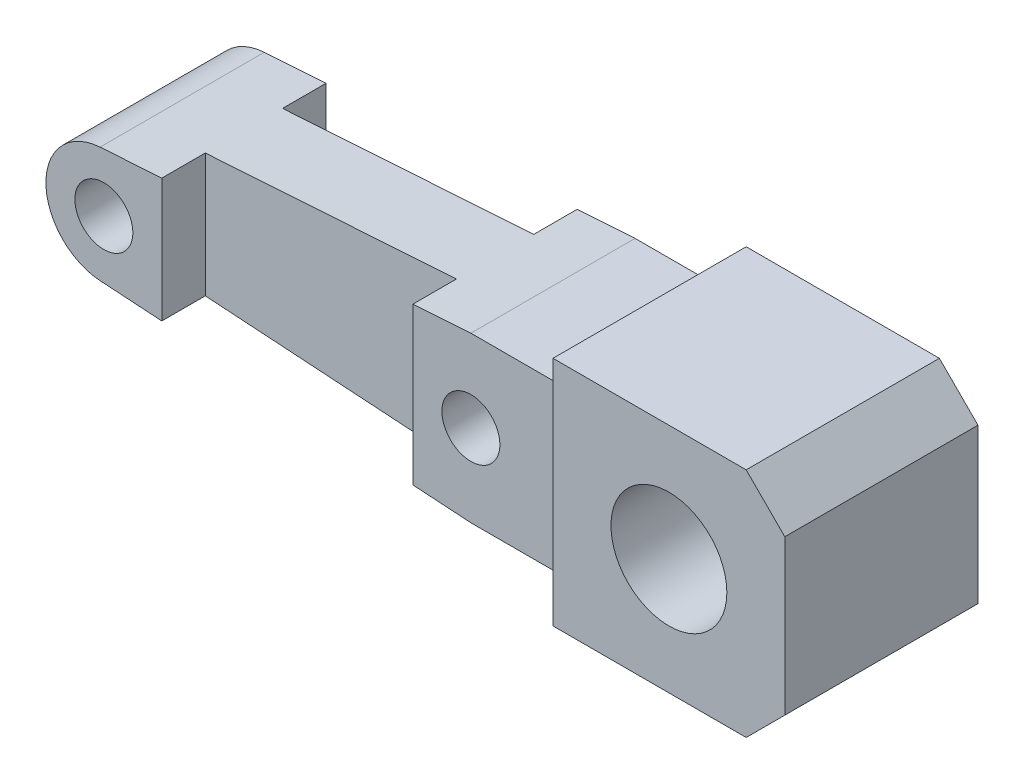
ISO-10303-21;
HEADER;
FILE_DESCRIPTION(('STEP AP214'),'2;1');
FILE_NAME('part.step','',(''),(''),'','','');
FILE_SCHEMA(('AUTOMOTIVE_DESIGN { 1 0 10303 214 1 1 1 1 }'));
ENDSEC;
DATA;
#1=APPLICATION_CONTEXT('core data for automotive mechanical design processes');
#2=APPLICATION_PROTOCOL_DEFINITION('international standard','automotive_design',2000,#1);
#3=PRODUCT_CONTEXT('',#1,'mechanical');
#4=PRODUCT('Part','Part','',(#3));
#5=PRODUCT_RELATED_PRODUCT_CATEGORY('part','',(#4));
#6=PRODUCT_DEFINITION_FORMATION('','',#4);
#7=PRODUCT_DEFINITION_CONTEXT('part definition',#1,'design');
#8=PRODUCT_DEFINITION('design','',#6,#7);
#9=PRODUCT_DEFINITION_SHAPE('','',#8);
#10=(LENGTH_UNIT() NAMED_UNIT(*) SI_UNIT(.MILLI.,.METRE.));
#11=(NAMED_UNIT(*) PLANE_ANGLE_UNIT() SI_UNIT($,.RADIAN.));
#12=(NAMED_UNIT(*) SI_UNIT($,.STERADIAN.) SOLID_ANGLE_UNIT());
#13=UNCERTAINTY_MEASURE_WITH_UNIT(LENGTH_MEASURE(1.E-05),#10,'distance_accuracy_value','');
#14=(GEOMETRIC_REPRESENTATION_CONTEXT(3) GLOBAL_UNCERTAINTY_ASSIGNED_CONTEXT((#13)) GLOBAL_UNIT_ASSIGNED_CONTEXT((#10,
#11,#12)) REPRESENTATION_CONTEXT('',''));
#15=CARTESIAN_POINT('',(0.,0.,0.));
#16=DIRECTION('',(0.,0.,1.));
#17=DIRECTION('',(1.,0.,0.));
#18=AXIS2_PLACEMENT_3D('',#15,#16,#17);
#19=CARTESIAN_POINT('',(-0.647809855023762,-9.8975356751646,20.));
#20=DIRECTION('',(-0.0653118854111001,-0.997864899484919,0.));
#21=DIRECTION('',(0.997864899484919,-0.0653118854111001,0.));
#22=AXIS2_PLACEMENT_3D('',#19,#20,#21);
#23=PLANE('',#22);
#24=DIRECTION('',(-0.997864899484919,0.0653118854111001,0.));
#25=VECTOR('',#24,1.);
#26=CARTESIAN_POINT('',(-0.647809855023762,-9.8975356751646,1.5));
#27=LINE('',#26,#25);
#28=CARTESIAN_POINT('',(-54.,-6.40554780087564,1.5));
#29=VERTEX_POINT('',#28);
#30=CARTESIAN_POINT('',(-60.3918713124666,-5.98718939690953,1.5));
#31=VERTEX_POINT('',#30);
#32=EDGE_CURVE('E48',#29,#31,#27,.T.);
#33=ORIENTED_EDGE('',*,*,#32,.F.);
#34=DIRECTION('',(0.,0.,1.));
#35=VECTOR('',#34,1.);
#36=CARTESIAN_POINT('',(-54.,-6.40554780087564,20.));
#37=LINE('',#36,#35);
#38=CARTESIAN_POINT('',(-54.,-6.40554780087564,6.));
#39=VERTEX_POINT('',#38);
#40=EDGE_CURVE('E356',#29,#39,#37,.T.);
#41=ORIENTED_EDGE('',*,*,#40,.T.);
#42=DIRECTION('',(-0.997864899484919,0.0653118854111001,0.));
#43=VECTOR('',#42,1.);
#44=CARTESIAN_POINT('',(-0.647809855023762,-9.8975356751646,6.));
#45=LINE('',#44,#43);
#46=CARTESIAN_POINT('',(-28.,-8.10729021266419,6.));
#47=VERTEX_POINT('',#46);
#48=EDGE_CURVE('E353',#47,#39,#45,.T.);
#49=ORIENTED_EDGE('',*,*,#48,.F.);
#50=DIRECTION('',(0.,0.,-1.));
#51=VECTOR('',#50,1.);
#52=CARTESIAN_POINT('',(-28.,-8.10729021266419,6.));
#53=LINE('',#52,#51);
#54=CARTESIAN_POINT('',(-28.,-8.10729021266419,1.5));
#55=VERTEX_POINT('',#54);
#56=EDGE_CURVE('E337',#47,#55,#53,.T.);
#57=ORIENTED_EDGE('',*,*,#56,.T.);
#58=DIRECTION('',(-0.997864899484919,0.0653118854111001,0.));
#59=VECTOR('',#58,1.);
#60=CARTESIAN_POINT('',(-0.647809855023762,-9.8975356751646,1.5));
#61=LINE('',#60,#59);
#62=CARTESIAN_POINT('',(-22.,-8.50000000000001,1.5));
#63=VERTEX_POINT('',#62);
#64=EDGE_CURVE('E377',#63,#55,#61,.T.);
#65=ORIENTED_EDGE('',*,*,#64,.F.);
#66=DIRECTION('',(0.,0.,-1.));
#67=VECTOR('',#66,1.);
#68=CARTESIAN_POINT('',(-22.,-8.50000000000001,20.));
#69=LINE('',#68,#67);
#70=CARTESIAN_POINT('',(-22.,-8.50000000000001,18.5));
#71=VERTEX_POINT('',#70);
#72=EDGE_CURVE('E174',#71,#63,#69,.T.);
#73=ORIENTED_EDGE('',*,*,#72,.F.);
#74=DIRECTION('',(0.997864899484919,-0.0653118854111001,0.));
#75=VECTOR('',#74,1.);
#76=CARTESIAN_POINT('',(-0.647809855023762,-9.8975356751646,18.5));
#77=LINE('',#76,#75);
#78=CARTESIAN_POINT('',(-28.,-8.10729021266419,18.5));
#79=VERTEX_POINT('',#78);
#80=EDGE_CURVE('E142',#79,#71,#77,.T.);
#81=ORIENTED_EDGE('',*,*,#80,.F.);
#82=DIRECTION('',(0.,0.,1.));
#83=VECTOR('',#82,1.);
#84=CARTESIAN_POINT('',(-28.,-8.10729021266419,14.));
#85=LINE('',#84,#83);
#86=CARTESIAN_POINT('',(-28.,-8.10729021266419,14.));
#87=VERTEX_POINT('',#86);
#88=EDGE_CURVE('E386',#87,#79,#85,.T.);
#89=ORIENTED_EDGE('',*,*,#88,.F.);
#90=DIRECTION('',(0.997864899484919,-0.0653118854111001,0.));
#91=VECTOR('',#90,1.);
#92=CARTESIAN_POINT('',(-0.647809855023762,-9.8975356751646,14.));
#93=LINE('',#92,#91);
#94=CARTESIAN_POINT('',(-54.,-6.40554780087564,14.));
#95=VERTEX_POINT('',#94);
#96=EDGE_CURVE('E394',#95,#87,#93,.T.);
#97=ORIENTED_EDGE('',*,*,#96,.F.);
#98=DIRECTION('',(0.,0.,-1.));
#99=VECTOR('',#98,1.);
#100=CARTESIAN_POINT('',(-54.,-6.40554780087564,20.));
#101=LINE('',#100,#99);
#102=CARTESIAN_POINT('',(-54.,-6.40554780087564,18.5));
#103=VERTEX_POINT('',#102);
#104=EDGE_CURVE('E210',#103,#95,#101,.T.);
#105=ORIENTED_EDGE('',*,*,#104,.F.);
#106=DIRECTION('',(0.997864899484919,-0.0653118854111001,0.));
#107=VECTOR('',#106,1.);
#108=CARTESIAN_POINT('',(-0.647809855023762,-9.8975356751646,18.5));
#109=LINE('',#108,#107);
#110=CARTESIAN_POINT('',(-60.3918713124666,-5.98718939690953,18.5));
#111=VERTEX_POINT('',#110);
#112=EDGE_CURVE('E206',#111,#103,#109,.T.);
#113=ORIENTED_EDGE('',*,*,#112,.F.);
#114=DIRECTION('',(0.,0.,-1.));
#115=VECTOR('',#114,1.);
#116=CARTESIAN_POINT('',(-60.3918713124666,-5.98718939690953,20.));
#117=LINE('',#116,#115);
#118=EDGE_CURVE('E134',#111,#31,#117,.T.);
#119=ORIENTED_EDGE('',*,*,#118,.T.);
#120=EDGE_LOOP('',(#33,#41,#49,#57,#65,#73,#81,#89,#97,#105,#113,#119));
#121=FACE_BOUND('',#120,.T.);
#122=ADVANCED_FACE('F34',(#121),#23,.T.);
#123=CARTESIAN_POINT('',(-0.647809855023766,9.8975356751646,20.));
#124=DIRECTION('',(0.0653118854111005,-0.997864899484919,0.));
#125=DIRECTION('',(0.997864899484919,0.0653118854111005,0.));
#126=AXIS2_PLACEMENT_3D('',#123,#124,#125);
#127=PLANE('',#126);
#128=DIRECTION('',(0.,0.,-1.));
#129=VECTOR('',#128,1.);
#130=CARTESIAN_POINT('',(-28.,8.10729021266418,6.));
#131=LINE('',#130,#129);
#132=CARTESIAN_POINT('',(-28.,8.10729021266418,6.));
#133=VERTEX_POINT('',#132);
#134=CARTESIAN_POINT('',(-28.,8.10729021266418,1.5));
#135=VERTEX_POINT('',#134);
#136=EDGE_CURVE('E347',#133,#135,#131,.T.);
#137=ORIENTED_EDGE('',*,*,#136,.F.);
#138=DIRECTION('',(-0.997864899484919,-0.0653118854111005,0.));
#139=VECTOR('',#138,1.);
#140=CARTESIAN_POINT('',(-0.647809855023766,9.8975356751646,6.));
#141=LINE('',#140,#139);
#142=CARTESIAN_POINT('',(-54.,6.40554780087562,6.));
#143=VERTEX_POINT('',#142);
#144=EDGE_CURVE('E11',#133,#143,#141,.T.);
#145=ORIENTED_EDGE('',*,*,#144,.T.);
#146=DIRECTION('',(0.,0.,1.));
#147=VECTOR('',#146,1.);
#148=CARTESIAN_POINT('',(-54.,6.40554780087562,20.));
#149=LINE('',#148,#147);
#150=CARTESIAN_POINT('',(-54.,6.40554780087562,1.5));
#151=VERTEX_POINT('',#150);
#152=EDGE_CURVE('E361',#151,#143,#149,.T.);
#153=ORIENTED_EDGE('',*,*,#152,.F.);
#154=DIRECTION('',(-0.997864899484919,-0.0653118854111005,0.));
#155=VECTOR('',#154,1.);
#156=CARTESIAN_POINT('',(-0.647809855023766,9.8975356751646,1.5));
#157=LINE('',#156,#155);
#158=CARTESIAN_POINT('',(-60.3918713124666,5.9871893969095,1.5));
#159=VERTEX_POINT('',#158);
#160=EDGE_CURVE('E359',#151,#159,#157,.T.);
#161=ORIENTED_EDGE('',*,*,#160,.T.);
#162=DIRECTION('',(0.,0.,-1.));
#163=VECTOR('',#162,1.);
#164=CARTESIAN_POINT('',(-60.3918713124666,5.9871893969095,20.));
#165=LINE('',#164,#163);
#166=CARTESIAN_POINT('',(-60.3918713124666,5.9871893969095,18.5));
#167=VERTEX_POINT('',#166);
#168=EDGE_CURVE('E153',#167,#159,#165,.T.);
#169=ORIENTED_EDGE('',*,*,#168,.F.);
#170=DIRECTION('',(0.997864899484919,0.0653118854111005,0.));
#171=VECTOR('',#170,1.);
#172=CARTESIAN_POINT('',(-0.647809855023766,9.8975356751646,18.5));
#173=LINE('',#172,#171);
#174=CARTESIAN_POINT('',(-54.,6.40554780087562,18.5));
#175=VERTEX_POINT('',#174);
#176=EDGE_CURVE('E218',#167,#175,#173,.T.);
#177=ORIENTED_EDGE('',*,*,#176,.T.);
#178=DIRECTION('',(0.,0.,-1.));
#179=VECTOR('',#178,1.);
#180=CARTESIAN_POINT('',(-54.,6.40554780087562,20.));
#181=LINE('',#180,#179);
#182=CARTESIAN_POINT('',(-54.,6.40554780087562,14.));
#183=VERTEX_POINT('',#182);
#184=EDGE_CURVE('E388',#175,#183,#181,.T.);
#185=ORIENTED_EDGE('',*,*,#184,.T.);
#186=DIRECTION('',(0.997864899484919,0.0653118854111005,0.));
#187=VECTOR('',#186,1.);
#188=CARTESIAN_POINT('',(-0.647809855023766,9.8975356751646,14.));
#189=LINE('',#188,#187);
#190=CARTESIAN_POINT('',(-28.,8.10729021266418,14.));
#191=VERTEX_POINT('',#190);
#192=EDGE_CURVE('E185',#183,#191,#189,.T.);
#193=ORIENTED_EDGE('',*,*,#192,.T.);
#194=DIRECTION('',(0.,0.,1.));
#195=VECTOR('',#194,1.);
#196=CARTESIAN_POINT('',(-28.,8.10729021266418,14.));
#197=LINE('',#196,#195);
#198=CARTESIAN_POINT('',(-28.,8.10729021266418,18.5));
#199=VERTEX_POINT('',#198);
#200=EDGE_CURVE('E385',#191,#199,#197,.T.);
#201=ORIENTED_EDGE('',*,*,#200,.T.);
#202=DIRECTION('',(0.997864899484919,0.0653118854111005,0.));
#203=VECTOR('',#202,1.);
#204=CARTESIAN_POINT('',(-0.647809855023766,9.8975356751646,18.5));
#205=LINE('',#204,#203);
#206=CARTESIAN_POINT('',(-22.0000000000002,8.49999999999999,18.5));
#207=VERTEX_POINT('',#206);
#208=EDGE_CURVE('E181',#199,#207,#205,.T.);
#209=ORIENTED_EDGE('',*,*,#208,.T.);
#210=DIRECTION('',(0.,0.,-1.));
#211=VECTOR('',#210,1.);
#212=CARTESIAN_POINT('',(-22.,8.49999999999999,20.));
#213=LINE('',#212,#211);
#214=CARTESIAN_POINT('',(-22.0000000000002,8.49999999999999,1.5));
#215=VERTEX_POINT('',#214);
#216=EDGE_CURVE('E156',#207,#215,#213,.T.);
#217=ORIENTED_EDGE('',*,*,#216,.T.);
#218=DIRECTION('',(-0.997864899484919,-0.0653118854111005,0.));
#219=VECTOR('',#218,1.);
#220=CARTESIAN_POINT('',(-0.647809855023766,9.8975356751646,1.5));
#221=LINE('',#220,#219);
#222=EDGE_CURVE('E190',#215,#135,#221,.T.);
#223=ORIENTED_EDGE('',*,*,#222,.T.);
#224=EDGE_LOOP('',(#137,#145,#153,#161,#169,#177,#185,#193,#201,#209,#217,#223));
#225=FACE_BOUND('',#224,.T.);
#226=ADVANCED_FACE('F398',(#225),#127,.F.);
#227=CARTESIAN_POINT('',(0.,0.,0.));
#228=DIRECTION('',(0.,0.,1.));
#229=DIRECTION('',(1.,0.,0.));
#230=AXIS2_PLACEMENT_3D('',#227,#228,#229);
#231=PLANE('',#230);
#232=CARTESIAN_POINT('',(0.,0.,0.));
#233=DIRECTION('',(0.,0.,1.));
#234=DIRECTION('',(1.,0.,0.));
#235=AXIS2_PLACEMENT_3D('',#232,#233,#234);
#236=CIRCLE('',#235,6.);
#237=CARTESIAN_POINT('',(6.,0.,0.));
#238=VERTEX_POINT('',#237);
#239=EDGE_CURVE('E137',#238,#238,#236,.T.);
#240=ORIENTED_EDGE('',*,*,#239,.T.);
#241=EDGE_LOOP('',(#240));
#242=FACE_BOUND('',#241,.T.);
#243=DIRECTION('',(-1.,0.,0.));
#244=VECTOR('',#243,1.);
#245=CARTESIAN_POINT('',(0.,-12.,0.));
#246=LINE('',#245,#244);
#247=CARTESIAN_POINT('',(8.,-12.,0.));
#248=VERTEX_POINT('',#247);
#249=CARTESIAN_POINT('',(-12.,-12.,0.));
#250=VERTEX_POINT('',#249);
#251=EDGE_CURVE('E138',#248,#250,#246,.T.);
#252=ORIENTED_EDGE('',*,*,#251,.T.);
#253=DIRECTION('',(0.,-1.,0.));
#254=VECTOR('',#253,1.);
#255=CARTESIAN_POINT('',(-12.,0.,0.));
#256=LINE('',#255,#254);
#257=CARTESIAN_POINT('',(-12.,12.,0.));
#258=VERTEX_POINT('',#257);
#259=EDGE_CURVE('E135',#258,#250,#256,.T.);
#260=ORIENTED_EDGE('',*,*,#259,.F.);
#261=DIRECTION('',(-1.,0.,0.));
#262=VECTOR('',#261,1.);
#263=CARTESIAN_POINT('',(0.,12.,0.));
#264=LINE('',#263,#262);
#265=CARTESIAN_POINT('',(8.,12.,0.));
#266=VERTEX_POINT('',#265);
#267=EDGE_CURVE('E86',#266,#258,#264,.T.);
#268=ORIENTED_EDGE('',*,*,#267,.F.);
#269=DIRECTION('',(-0.707106781186548,0.707106781186547,0.));
#270=VECTOR('',#269,1.);
#271=CARTESIAN_POINT('',(10.,10.,0.));
#272=LINE('',#271,#270);
#273=CARTESIAN_POINT('',(12.,8.,0.));
#274=VERTEX_POINT('',#273);
#275=EDGE_CURVE('E146',#274,#266,#272,.T.);
#276=ORIENTED_EDGE('',*,*,#275,.F.);
#277=DIRECTION('',(0.,-1.,0.));
#278=VECTOR('',#277,1.);
#279=CARTESIAN_POINT('',(12.,0.,0.));
#280=LINE('',#279,#278);
#281=CARTESIAN_POINT('',(12.,-8.,0.));
#282=VERTEX_POINT('',#281);
#283=EDGE_CURVE('E108',#274,#282,#280,.T.);
#284=ORIENTED_EDGE('',*,*,#283,.T.);
#285=DIRECTION('',(-0.707106781186548,-0.707106781186548,0.));
#286=VECTOR('',#285,1.);
#287=CARTESIAN_POINT('',(10.,-10.,0.));
#288=LINE('',#287,#286);
#289=EDGE_CURVE('E141',#282,#248,#288,.T.);
#290=ORIENTED_EDGE('',*,*,#289,.T.);
#291=EDGE_LOOP('',(#252,#260,#268,#276,#284,#290));
#292=FACE_BOUND('',#291,.T.);
#293=ADVANCED_FACE('F250',(#242,#292),#231,.F.);
#294=CARTESIAN_POINT('',(0.,0.,20.));
#295=DIRECTION('',(0.,0.,1.));
#296=DIRECTION('',(1.,0.,0.));
#297=AXIS2_PLACEMENT_3D('',#294,#295,#296);
#298=PLANE('',#297);
#299=DIRECTION('',(-1.,0.,0.));
#300=VECTOR('',#299,1.);
#301=CARTESIAN_POINT('',(0.,12.,20.));
#302=LINE('',#301,#300);
#303=CARTESIAN_POINT('',(8.,12.,20.));
#304=VERTEX_POINT('',#303);
#305=CARTESIAN_POINT('',(-12.,12.,20.));
#306=VERTEX_POINT('',#305);
#307=EDGE_CURVE('E118',#304,#306,#302,.T.);
#308=ORIENTED_EDGE('',*,*,#307,.T.);
#309=DIRECTION('',(0.,-1.,0.));
#310=VECTOR('',#309,1.);
#311=CARTESIAN_POINT('',(-12.,0.,20.));
#312=LINE('',#311,#310);
#313=CARTESIAN_POINT('',(-12.,-12.,20.));
#314=VERTEX_POINT('',#313);
#315=EDGE_CURVE('E57',#306,#314,#312,.T.);
#316=ORIENTED_EDGE('',*,*,#315,.T.);
#317=DIRECTION('',(-1.,0.,0.));
#318=VECTOR('',#317,1.);
#319=CARTESIAN_POINT('',(0.,-12.,20.));
#320=LINE('',#319,#318);
#321=CARTESIAN_POINT('',(8.,-12.,20.));
#322=VERTEX_POINT('',#321);
#323=EDGE_CURVE('E126',#322,#314,#320,.T.);
#324=ORIENTED_EDGE('',*,*,#323,.F.);
#325=DIRECTION('',(-0.707106781186548,-0.707106781186548,0.));
#326=VECTOR('',#325,1.);
#327=CARTESIAN_POINT('',(10.,-10.,20.));
#328=LINE('',#327,#326);
#329=CARTESIAN_POINT('',(12.,-8.,20.));
#330=VERTEX_POINT('',#329);
#331=EDGE_CURVE('E124',#330,#322,#328,.T.);
#332=ORIENTED_EDGE('',*,*,#331,.F.);
#333=DIRECTION('',(0.,-1.,0.));
#334=VECTOR('',#333,1.);
#335=CARTESIAN_POINT('',(12.,0.,20.));
#336=LINE('',#335,#334);
#337=CARTESIAN_POINT('',(12.,8.,20.));
#338=VERTEX_POINT('',#337);
#339=EDGE_CURVE('E106',#338,#330,#336,.T.);
#340=ORIENTED_EDGE('',*,*,#339,.F.);
#341=DIRECTION('',(-0.707106781186548,0.707106781186547,0.));
#342=VECTOR('',#341,1.);
#343=CARTESIAN_POINT('',(10.,10.,20.));
#344=LINE('',#343,#342);
#345=EDGE_CURVE('E115',#338,#304,#344,.T.);
#346=ORIENTED_EDGE('',*,*,#345,.T.);
#347=EDGE_LOOP('',(#308,#316,#324,#332,#340,#346));
#348=FACE_BOUND('',#347,.T.);
#349=CARTESIAN_POINT('',(0.,0.,20.));
#350=DIRECTION('',(0.,0.,1.));
#351=DIRECTION('',(1.,0.,0.));
#352=AXIS2_PLACEMENT_3D('',#349,#350,#351);
#353=CIRCLE('',#352,6.);
#354=CARTESIAN_POINT('',(6.,0.,20.));
#355=VERTEX_POINT('',#354);
#356=EDGE_CURVE('E131',#355,#355,#353,.T.);
#357=ORIENTED_EDGE('',*,*,#356,.F.);
#358=EDGE_LOOP('',(#357));
#359=FACE_BOUND('',#358,.T.);
#360=ADVANCED_FACE('F121',(#348,#359),#298,.T.);
#361=CARTESIAN_POINT('',(0.,-8.5,20.));
#362=DIRECTION('',(0.,-1.,0.));
#363=DIRECTION('',(1.,0.,0.));
#364=AXIS2_PLACEMENT_3D('',#361,#362,#363);
#365=PLANE('',#364);
#366=DIRECTION('',(1.,0.,0.));
#367=VECTOR('',#366,1.);
#368=CARTESIAN_POINT('',(-12.,-8.50000000000001,1.5));
#369=LINE('',#368,#367);
#370=CARTESIAN_POINT('',(-12.,-8.50000000000001,1.5));
#371=VERTEX_POINT('',#370);
#372=EDGE_CURVE('E274',#63,#371,#369,.T.);
#373=ORIENTED_EDGE('',*,*,#372,.T.);
#374=DIRECTION('',(0.,0.,-1.));
#375=VECTOR('',#374,1.);
#376=CARTESIAN_POINT('',(-12.,-8.5,20.));
#377=LINE('',#376,#375);
#378=CARTESIAN_POINT('',(-12.,-8.50000000000001,18.5));
#379=VERTEX_POINT('',#378);
#380=EDGE_CURVE('E171',#379,#371,#377,.T.);
#381=ORIENTED_EDGE('',*,*,#380,.F.);
#382=DIRECTION('',(1.,0.,0.));
#383=VECTOR('',#382,1.);
#384=CARTESIAN_POINT('',(-12.,-8.50000000000001,18.5));
#385=LINE('',#384,#383);
#386=EDGE_CURVE('E182',#71,#379,#385,.T.);
#387=ORIENTED_EDGE('',*,*,#386,.F.);
#388=ORIENTED_EDGE('',*,*,#72,.T.);
#389=EDGE_LOOP('',(#373,#381,#387,#388));
#390=FACE_BOUND('',#389,.T.);
#391=ADVANCED_FACE('F271',(#390),#365,.T.);
#392=CARTESIAN_POINT('',(0.,-12.,20.));
#393=DIRECTION('',(0.,-1.,0.));
#394=DIRECTION('',(1.,0.,0.));
#395=AXIS2_PLACEMENT_3D('',#392,#393,#394);
#396=PLANE('',#395);
#397=ORIENTED_EDGE('',*,*,#251,.F.);
#398=DIRECTION('',(0.,0.,-1.));
#399=VECTOR('',#398,1.);
#400=CARTESIAN_POINT('',(8.,-12.,20.));
#401=LINE('',#400,#399);
#402=EDGE_CURVE('E166',#322,#248,#401,.T.);
#403=ORIENTED_EDGE('',*,*,#402,.F.);
#404=ORIENTED_EDGE('',*,*,#323,.T.);
#405=DIRECTION('',(0.,0.,-1.));
#406=VECTOR('',#405,1.);
#407=CARTESIAN_POINT('',(-12.,-12.,20.));
#408=LINE('',#407,#406);
#409=EDGE_CURVE('E168',#314,#250,#408,.T.);
#410=ORIENTED_EDGE('',*,*,#409,.T.);
#411=EDGE_LOOP('',(#397,#403,#404,#410));
#412=FACE_BOUND('',#411,.T.);
#413=ADVANCED_FACE('F245',(#412),#396,.T.);
#414=CARTESIAN_POINT('',(10.,-10.,20.));
#415=DIRECTION('',(0.707106781186548,-0.707106781186548,0.));
#416=DIRECTION('',(0.707106781186548,0.707106781186548,0.));
#417=AXIS2_PLACEMENT_3D('',#414,#415,#416);
#418=PLANE('',#417);
#419=ORIENTED_EDGE('',*,*,#289,.F.);
#420=DIRECTION('',(0.,0.,-1.));
#421=VECTOR('',#420,1.);
#422=CARTESIAN_POINT('',(12.,-8.,20.));
#423=LINE('',#422,#421);
#424=EDGE_CURVE('E111',#330,#282,#423,.T.);
#425=ORIENTED_EDGE('',*,*,#424,.F.);
#426=ORIENTED_EDGE('',*,*,#331,.T.);
#427=ORIENTED_EDGE('',*,*,#402,.T.);
#428=EDGE_LOOP('',(#419,#425,#426,#427));
#429=FACE_BOUND('',#428,.T.);
#430=ADVANCED_FACE('F248',(#429),#418,.T.);
#431=CARTESIAN_POINT('',(12.,0.,20.));
#432=DIRECTION('',(1.,0.,0.));
#433=DIRECTION('',(0.,1.,0.));
#434=AXIS2_PLACEMENT_3D('',#431,#432,#433);
#435=PLANE('',#434);
#436=ORIENTED_EDGE('',*,*,#283,.F.);
#437=DIRECTION('',(0.,0.,-1.));
#438=VECTOR('',#437,1.);
#439=CARTESIAN_POINT('',(12.,8.,20.));
#440=LINE('',#439,#438);
#441=EDGE_CURVE('E102',#338,#274,#440,.T.);
#442=ORIENTED_EDGE('',*,*,#441,.F.);
#443=ORIENTED_EDGE('',*,*,#339,.T.);
#444=ORIENTED_EDGE('',*,*,#424,.T.);
#445=EDGE_LOOP('',(#436,#442,#443,#444));
#446=FACE_BOUND('',#445,.T.);
#447=ADVANCED_FACE('F104',(#446),#435,.T.);
#448=CARTESIAN_POINT('',(10.,10.,20.));
#449=DIRECTION('',(-0.707106781186547,-0.707106781186548,0.));
#450=DIRECTION('',(0.707106781186548,-0.707106781186547,0.));
#451=AXIS2_PLACEMENT_3D('',#448,#449,#450);
#452=PLANE('',#451);
#453=ORIENTED_EDGE('',*,*,#275,.T.);
#454=DIRECTION('',(0.,0.,-1.));
#455=VECTOR('',#454,1.);
#456=CARTESIAN_POINT('',(8.,12.,20.));
#457=LINE('',#456,#455);
#458=EDGE_CURVE('E112',#304,#266,#457,.T.);
#459=ORIENTED_EDGE('',*,*,#458,.F.);
#460=ORIENTED_EDGE('',*,*,#345,.F.);
#461=ORIENTED_EDGE('',*,*,#441,.T.);
#462=EDGE_LOOP('',(#453,#459,#460,#461));
#463=FACE_BOUND('',#462,.T.);
#464=ADVANCED_FACE('F116',(#463),#452,.F.);
#465=CARTESIAN_POINT('',(0.,12.,20.));
#466=DIRECTION('',(0.,-1.,0.));
#467=DIRECTION('',(1.,0.,0.));
#468=AXIS2_PLACEMENT_3D('',#465,#466,#467);
#469=PLANE('',#468);
#470=ORIENTED_EDGE('',*,*,#267,.T.);
#471=DIRECTION('',(0.,0.,-1.));
#472=VECTOR('',#471,1.);
#473=CARTESIAN_POINT('',(-12.,12.,20.));
#474=LINE('',#473,#472);
#475=EDGE_CURVE('E162',#306,#258,#474,.T.);
#476=ORIENTED_EDGE('',*,*,#475,.F.);
#477=ORIENTED_EDGE('',*,*,#307,.F.);
#478=ORIENTED_EDGE('',*,*,#458,.T.);
#479=EDGE_LOOP('',(#470,#476,#477,#478));
#480=FACE_BOUND('',#479,.T.);
#481=ADVANCED_FACE('F252',(#480),#469,.F.);
#482=CARTESIAN_POINT('',(-12.,0.,20.));
#483=DIRECTION('',(1.,0.,0.));
#484=DIRECTION('',(0.,1.,0.));
#485=AXIS2_PLACEMENT_3D('',#482,#483,#484);
#486=PLANE('',#485);
#487=ORIENTED_EDGE('',*,*,#259,.T.);
#488=ORIENTED_EDGE('',*,*,#409,.F.);
#489=ORIENTED_EDGE('',*,*,#315,.F.);
#490=ORIENTED_EDGE('',*,*,#475,.T.);
#491=EDGE_LOOP('',(#487,#488,#489,#490));
#492=FACE_BOUND('',#491,.T.);
#493=ORIENTED_EDGE('',*,*,#380,.T.);
#494=DIRECTION('',(0.,1.,0.));
#495=VECTOR('',#494,1.);
#496=CARTESIAN_POINT('',(-12.,8.5,1.5));
#497=LINE('',#496,#495);
#498=CARTESIAN_POINT('',(-12.,8.5,1.5));
#499=VERTEX_POINT('',#498);
#500=EDGE_CURVE('E265',#371,#499,#497,.T.);
#501=ORIENTED_EDGE('',*,*,#500,.T.);
#502=DIRECTION('',(0.,0.,-1.));
#503=VECTOR('',#502,1.);
#504=CARTESIAN_POINT('',(-12.,8.5,20.));
#505=LINE('',#504,#503);
#506=CARTESIAN_POINT('',(-12.,8.5,18.5));
#507=VERTEX_POINT('',#506);
#508=EDGE_CURVE('E159',#507,#499,#505,.T.);
#509=ORIENTED_EDGE('',*,*,#508,.F.);
#510=DIRECTION('',(0.,1.,0.));
#511=VECTOR('',#510,1.);
#512=CARTESIAN_POINT('',(-12.,8.5,18.5));
#513=LINE('',#512,#511);
#514=EDGE_CURVE('E221',#379,#507,#513,.T.);
#515=ORIENTED_EDGE('',*,*,#514,.F.);
#516=EDGE_LOOP('',(#493,#501,#509,#515));
#517=FACE_BOUND('',#516,.T.);
#518=ADVANCED_FACE('F253',(#492,#517),#486,.F.);
#519=CARTESIAN_POINT('',(0.,8.5,20.));
#520=DIRECTION('',(0.,-1.,0.));
#521=DIRECTION('',(1.,0.,0.));
#522=AXIS2_PLACEMENT_3D('',#519,#520,#521);
#523=PLANE('',#522);
#524=ORIENTED_EDGE('',*,*,#508,.T.);
#525=DIRECTION('',(-1.,0.,0.));
#526=VECTOR('',#525,1.);
#527=CARTESIAN_POINT('',(-12.,8.5,1.5));
#528=LINE('',#527,#526);
#529=EDGE_CURVE('E191',#499,#215,#528,.T.);
#530=ORIENTED_EDGE('',*,*,#529,.T.);
#531=ORIENTED_EDGE('',*,*,#216,.F.);
#532=DIRECTION('',(-1.,0.,0.));
#533=VECTOR('',#532,1.);
#534=CARTESIAN_POINT('',(-12.,8.5,18.5));
#535=LINE('',#534,#533);
#536=EDGE_CURVE('E230',#507,#207,#535,.T.);
#537=ORIENTED_EDGE('',*,*,#536,.F.);
#538=EDGE_LOOP('',(#524,#530,#531,#537));
#539=FACE_BOUND('',#538,.T.);
#540=ADVANCED_FACE('F256',(#539),#523,.F.);
#541=CARTESIAN_POINT('',(-22.,0.,20.));
#542=DIRECTION('',(0.,0.,-1.));
#543=DIRECTION('',(-1.,0.,0.));
#544=AXIS2_PLACEMENT_3D('',#541,#542,#543);
#545=CYLINDRICAL_SURFACE('',#544,3.);
#546=CARTESIAN_POINT('',(-22.,0.,1.5));
#547=DIRECTION('',(0.,0.,1.));
#548=DIRECTION('',(1.,0.,0.));
#549=AXIS2_PLACEMENT_3D('',#546,#547,#548);
#550=CIRCLE('',#549,3.);
#551=CARTESIAN_POINT('',(-19.,0.,1.5));
#552=VERTEX_POINT('',#551);
#553=EDGE_CURVE('E188',#552,#552,#550,.T.);
#554=ORIENTED_EDGE('',*,*,#553,.F.);
#555=EDGE_LOOP('',(#554));
#556=FACE_BOUND('',#555,.T.);
#557=CARTESIAN_POINT('',(-22.,0.,18.5));
#558=DIRECTION('',(0.,0.,-1.));
#559=DIRECTION('',(-1.,0.,0.));
#560=AXIS2_PLACEMENT_3D('',#557,#558,#559);
#561=CIRCLE('',#560,3.);
#562=CARTESIAN_POINT('',(-25.,0.,18.5));
#563=VERTEX_POINT('',#562);
#564=EDGE_CURVE('E178',#563,#563,#561,.T.);
#565=ORIENTED_EDGE('',*,*,#564,.F.);
#566=EDGE_LOOP('',(#565));
#567=FACE_BOUND('',#566,.T.);
#568=ADVANCED_FACE('F446',(#556,#567),#545,.F.);
#569=CARTESIAN_POINT('',(-60.,0.,20.));
#570=DIRECTION('',(0.,0.,-1.));
#571=DIRECTION('',(-1.,0.,0.));
#572=AXIS2_PLACEMENT_3D('',#569,#570,#571);
#573=CYLINDRICAL_SURFACE('',#572,3.00000000000001);
#574=CARTESIAN_POINT('',(-60.,0.,1.5));
#575=DIRECTION('',(0.,0.,1.));
#576=DIRECTION('',(1.,0.,0.));
#577=AXIS2_PLACEMENT_3D('',#574,#575,#576);
#578=CIRCLE('',#577,3.00000000000001);
#579=CARTESIAN_POINT('',(-57.,0.,1.5));
#580=VERTEX_POINT('',#579);
#581=EDGE_CURVE('E367',#580,#580,#578,.T.);
#582=ORIENTED_EDGE('',*,*,#581,.F.);
#583=EDGE_LOOP('',(#582));
#584=FACE_BOUND('',#583,.T.);
#585=CARTESIAN_POINT('',(-60.,0.,18.5));
#586=DIRECTION('',(0.,0.,-1.));
#587=DIRECTION('',(-1.,0.,0.));
#588=AXIS2_PLACEMENT_3D('',#585,#586,#587);
#589=CIRCLE('',#588,3.00000000000001);
#590=CARTESIAN_POINT('',(-63.,0.,18.5));
#591=VERTEX_POINT('',#590);
#592=EDGE_CURVE('E217',#591,#591,#589,.T.);
#593=ORIENTED_EDGE('',*,*,#592,.F.);
#594=EDGE_LOOP('',(#593));
#595=FACE_BOUND('',#594,.T.);
#596=ADVANCED_FACE('F472',(#584,#595),#573,.F.);
#597=CARTESIAN_POINT('',(-60.,0.,20.));
#598=DIRECTION('',(0.,0.,-1.));
#599=DIRECTION('',(-1.,0.,0.));
#600=AXIS2_PLACEMENT_3D('',#597,#598,#599);
#601=CYLINDRICAL_SURFACE('',#600,6.);
#602=ORIENTED_EDGE('',*,*,#168,.T.);
#603=CARTESIAN_POINT('',(-60.,0.,1.5));
#604=DIRECTION('',(0.,0.,1.));
#605=DIRECTION('',(1.,0.,0.));
#606=AXIS2_PLACEMENT_3D('',#603,#604,#605);
#607=CIRCLE('',#606,6.);
#608=EDGE_CURVE('E41',#159,#31,#607,.T.);
#609=ORIENTED_EDGE('',*,*,#608,.T.);
#610=ORIENTED_EDGE('',*,*,#118,.F.);
#611=CARTESIAN_POINT('',(-60.,0.,18.5));
#612=DIRECTION('',(0.,0.,-1.));
#613=DIRECTION('',(-1.,0.,0.));
#614=AXIS2_PLACEMENT_3D('',#611,#612,#613);
#615=CIRCLE('',#614,6.);
#616=EDGE_CURVE('E177',#111,#167,#615,.T.);
#617=ORIENTED_EDGE('',*,*,#616,.T.);
#618=EDGE_LOOP('',(#602,#609,#610,#617));
#619=FACE_BOUND('',#618,.T.);
#620=ADVANCED_FACE('F194',(#619),#601,.T.);
#621=CARTESIAN_POINT('',(0.,0.,20.));
#622=DIRECTION('',(0.,0.,-1.));
#623=DIRECTION('',(-1.,0.,0.));
#624=AXIS2_PLACEMENT_3D('',#621,#622,#623);
#625=CYLINDRICAL_SURFACE('',#624,6.);
#626=ORIENTED_EDGE('',*,*,#356,.T.);
#627=EDGE_LOOP('',(#626));
#628=FACE_BOUND('',#627,.T.);
#629=ORIENTED_EDGE('',*,*,#239,.F.);
#630=EDGE_LOOP('',(#629));
#631=FACE_BOUND('',#630,.T.);
#632=ADVANCED_FACE('F467',(#628,#631),#625,.F.);
#633=CARTESIAN_POINT('',(0.,0.,18.5));
#634=DIRECTION('',(0.,0.,-1.));
#635=DIRECTION('',(-1.,0.,0.));
#636=AXIS2_PLACEMENT_3D('',#633,#634,#635);
#637=PLANE('',#636);
#638=ORIENTED_EDGE('',*,*,#80,.T.);
#639=ORIENTED_EDGE('',*,*,#386,.T.);
#640=ORIENTED_EDGE('',*,*,#514,.T.);
#641=ORIENTED_EDGE('',*,*,#536,.T.);
#642=ORIENTED_EDGE('',*,*,#208,.F.);
#643=DIRECTION('',(0.,-1.,0.));
#644=VECTOR('',#643,1.);
#645=CARTESIAN_POINT('',(-28.,8.49999999999999,18.5));
#646=LINE('',#645,#644);
#647=EDGE_CURVE('E233',#199,#79,#646,.T.);
#648=ORIENTED_EDGE('',*,*,#647,.T.);
#649=EDGE_LOOP('',(#638,#639,#640,#641,#642,#648));
#650=FACE_BOUND('',#649,.T.);
#651=ORIENTED_EDGE('',*,*,#564,.T.);
#652=EDGE_LOOP('',(#651));
#653=FACE_BOUND('',#652,.T.);
#654=ADVANCED_FACE('F414',(#650,#653),#637,.F.);
#655=CARTESIAN_POINT('',(0.,0.,18.5));
#656=DIRECTION('',(0.,0.,-1.));
#657=DIRECTION('',(-1.,0.,0.));
#658=AXIS2_PLACEMENT_3D('',#655,#656,#657);
#659=PLANE('',#658);
#660=ORIENTED_EDGE('',*,*,#592,.T.);
#661=EDGE_LOOP('',(#660));
#662=FACE_BOUND('',#661,.T.);
#663=ORIENTED_EDGE('',*,*,#112,.T.);
#664=DIRECTION('',(0.,1.,0.));
#665=VECTOR('',#664,1.);
#666=CARTESIAN_POINT('',(-54.,-12.6988341131735,18.5));
#667=LINE('',#666,#665);
#668=EDGE_CURVE('E224',#103,#175,#667,.T.);
#669=ORIENTED_EDGE('',*,*,#668,.T.);
#670=ORIENTED_EDGE('',*,*,#176,.F.);
#671=ORIENTED_EDGE('',*,*,#616,.F.);
#672=EDGE_LOOP('',(#663,#669,#670,#671));
#673=FACE_BOUND('',#672,.T.);
#674=ADVANCED_FACE('F395',(#662,#673),#659,.F.);
#675=CARTESIAN_POINT('',(0.,0.,14.));
#676=DIRECTION('',(0.,0.,-1.));
#677=DIRECTION('',(-1.,0.,0.));
#678=AXIS2_PLACEMENT_3D('',#675,#676,#677);
#679=PLANE('',#678);
#680=ORIENTED_EDGE('',*,*,#96,.T.);
#681=DIRECTION('',(0.,1.,0.));
#682=VECTOR('',#681,1.);
#683=CARTESIAN_POINT('',(-28.,8.10729021266418,14.));
#684=LINE('',#683,#682);
#685=EDGE_CURVE('E379',#87,#191,#684,.T.);
#686=ORIENTED_EDGE('',*,*,#685,.T.);
#687=ORIENTED_EDGE('',*,*,#192,.F.);
#688=DIRECTION('',(0.,-1.,0.));
#689=VECTOR('',#688,1.);
#690=CARTESIAN_POINT('',(-54.,8.10729021266417,14.));
#691=LINE('',#690,#689);
#692=EDGE_CURVE('E382',#183,#95,#691,.T.);
#693=ORIENTED_EDGE('',*,*,#692,.T.);
#694=EDGE_LOOP('',(#680,#686,#687,#693));
#695=FACE_BOUND('',#694,.T.);
#696=ADVANCED_FACE('F421',(#695),#679,.F.);
#697=CARTESIAN_POINT('',(-28.,8.10729021266418,14.));
#698=DIRECTION('',(1.,0.,0.));
#699=DIRECTION('',(0.,0.,-1.));
#700=AXIS2_PLACEMENT_3D('',#697,#698,#699);
#701=PLANE('',#700);
#702=ORIENTED_EDGE('',*,*,#200,.F.);
#703=ORIENTED_EDGE('',*,*,#685,.F.);
#704=ORIENTED_EDGE('',*,*,#88,.T.);
#705=ORIENTED_EDGE('',*,*,#647,.F.);
#706=EDGE_LOOP('',(#702,#703,#704,#705));
#707=FACE_BOUND('',#706,.T.);
#708=ADVANCED_FACE('F417',(#707),#701,.F.);
#709=CARTESIAN_POINT('',(-54.,8.10729021266417,14.));
#710=DIRECTION('',(-1.,0.,0.));
#711=DIRECTION('',(0.,0.,1.));
#712=AXIS2_PLACEMENT_3D('',#709,#710,#711);
#713=PLANE('',#712);
#714=ORIENTED_EDGE('',*,*,#104,.T.);
#715=ORIENTED_EDGE('',*,*,#692,.F.);
#716=ORIENTED_EDGE('',*,*,#184,.F.);
#717=ORIENTED_EDGE('',*,*,#668,.F.);
#718=EDGE_LOOP('',(#714,#715,#716,#717));
#719=FACE_BOUND('',#718,.T.);
#720=ADVANCED_FACE('F422',(#719),#713,.F.);
#721=CARTESIAN_POINT('',(0.,0.,1.5));
#722=DIRECTION('',(0.,0.,1.));
#723=DIRECTION('',(-1.,0.,0.));
#724=AXIS2_PLACEMENT_3D('',#721,#722,#723);
#725=PLANE('',#724);
#726=ORIENTED_EDGE('',*,*,#64,.T.);
#727=DIRECTION('',(0.,-1.,0.));
#728=VECTOR('',#727,1.);
#729=CARTESIAN_POINT('',(-28.,8.49999999999999,1.5));
#730=LINE('',#729,#728);
#731=EDGE_CURVE('E343',#135,#55,#730,.T.);
#732=ORIENTED_EDGE('',*,*,#731,.F.);
#733=ORIENTED_EDGE('',*,*,#222,.F.);
#734=ORIENTED_EDGE('',*,*,#529,.F.);
#735=ORIENTED_EDGE('',*,*,#500,.F.);
#736=ORIENTED_EDGE('',*,*,#372,.F.);
#737=EDGE_LOOP('',(#726,#732,#733,#734,#735,#736));
#738=FACE_BOUND('',#737,.T.);
#739=ORIENTED_EDGE('',*,*,#553,.T.);
#740=EDGE_LOOP('',(#739));
#741=FACE_BOUND('',#740,.T.);
#742=ADVANCED_FACE('F406',(#738,#741),#725,.F.);
#743=CARTESIAN_POINT('',(0.,0.,1.5));
#744=DIRECTION('',(0.,0.,1.));
#745=DIRECTION('',(-1.,0.,0.));
#746=AXIS2_PLACEMENT_3D('',#743,#744,#745);
#747=PLANE('',#746);
#748=ORIENTED_EDGE('',*,*,#581,.T.);
#749=EDGE_LOOP('',(#748));
#750=FACE_BOUND('',#749,.T.);
#751=ORIENTED_EDGE('',*,*,#32,.T.);
#752=ORIENTED_EDGE('',*,*,#608,.F.);
#753=ORIENTED_EDGE('',*,*,#160,.F.);
#754=DIRECTION('',(0.,1.,0.));
#755=VECTOR('',#754,1.);
#756=CARTESIAN_POINT('',(-54.,-12.6988341131735,1.5));
#757=LINE('',#756,#755);
#758=EDGE_CURVE('E357',#29,#151,#757,.T.);
#759=ORIENTED_EDGE('',*,*,#758,.F.);
#760=EDGE_LOOP('',(#751,#752,#753,#759));
#761=FACE_BOUND('',#760,.T.);
#762=ADVANCED_FACE('F400',(#750,#761),#747,.F.);
#763=CARTESIAN_POINT('',(0.,0.,6.));
#764=DIRECTION('',(0.,0.,1.));
#765=DIRECTION('',(-1.,0.,0.));
#766=AXIS2_PLACEMENT_3D('',#763,#764,#765);
#767=PLANE('',#766);
#768=ORIENTED_EDGE('',*,*,#48,.T.);
#769=DIRECTION('',(0.,-1.,0.));
#770=VECTOR('',#769,1.);
#771=CARTESIAN_POINT('',(-54.,8.10729021266417,6.));
#772=LINE('',#771,#770);
#773=EDGE_CURVE('E348',#143,#39,#772,.T.);
#774=ORIENTED_EDGE('',*,*,#773,.F.);
#775=ORIENTED_EDGE('',*,*,#144,.F.);
#776=DIRECTION('',(0.,1.,0.));
#777=VECTOR('',#776,1.);
#778=CARTESIAN_POINT('',(-28.,8.10729021266418,6.));
#779=LINE('',#778,#777);
#780=EDGE_CURVE('E340',#47,#133,#779,.T.);
#781=ORIENTED_EDGE('',*,*,#780,.F.);
#782=EDGE_LOOP('',(#768,#774,#775,#781));
#783=FACE_BOUND('',#782,.T.);
#784=ADVANCED_FACE('F351',(#783),#767,.F.);
#785=CARTESIAN_POINT('',(-28.,8.10729021266418,6.));
#786=DIRECTION('',(-1.,0.,0.));
#787=DIRECTION('',(0.,0.,1.));
#788=AXIS2_PLACEMENT_3D('',#785,#786,#787);
#789=PLANE('',#788);
#790=ORIENTED_EDGE('',*,*,#731,.T.);
#791=ORIENTED_EDGE('',*,*,#56,.F.);
#792=ORIENTED_EDGE('',*,*,#780,.T.);
#793=ORIENTED_EDGE('',*,*,#136,.T.);
#794=EDGE_LOOP('',(#790,#791,#792,#793));
#795=FACE_BOUND('',#794,.T.);
#796=ADVANCED_FACE('F339',(#795),#789,.T.);
#797=CARTESIAN_POINT('',(-54.,8.10729021266417,6.));
#798=DIRECTION('',(1.,0.,0.));
#799=DIRECTION('',(0.,0.,-1.));
#800=AXIS2_PLACEMENT_3D('',#797,#798,#799);
#801=PLANE('',#800);
#802=ORIENTED_EDGE('',*,*,#758,.T.);
#803=ORIENTED_EDGE('',*,*,#152,.T.);
#804=ORIENTED_EDGE('',*,*,#773,.T.);
#805=ORIENTED_EDGE('',*,*,#40,.F.);
#806=EDGE_LOOP('',(#802,#803,#804,#805));
#807=FACE_BOUND('',#806,.T.);
#808=ADVANCED_FACE('F402',(#807),#801,.T.);
#809=CLOSED_SHELL('',(#122,#226,#293,#360,#391,#413,#430,#447,#464,#481,#518,#540,#568,#596,
#620,#632,#654,#674,#696,#708,#720,#742,#762,#784,#796,#808));
#810=MANIFOLD_SOLID_BREP('B2',#809);
#811=ADVANCED_BREP_SHAPE_REPRESENTATION('',(#18,#810),#14);
#812=SHAPE_DEFINITION_REPRESENTATION(#9,#811);
ENDSEC;
END-ISO-10303-21;
